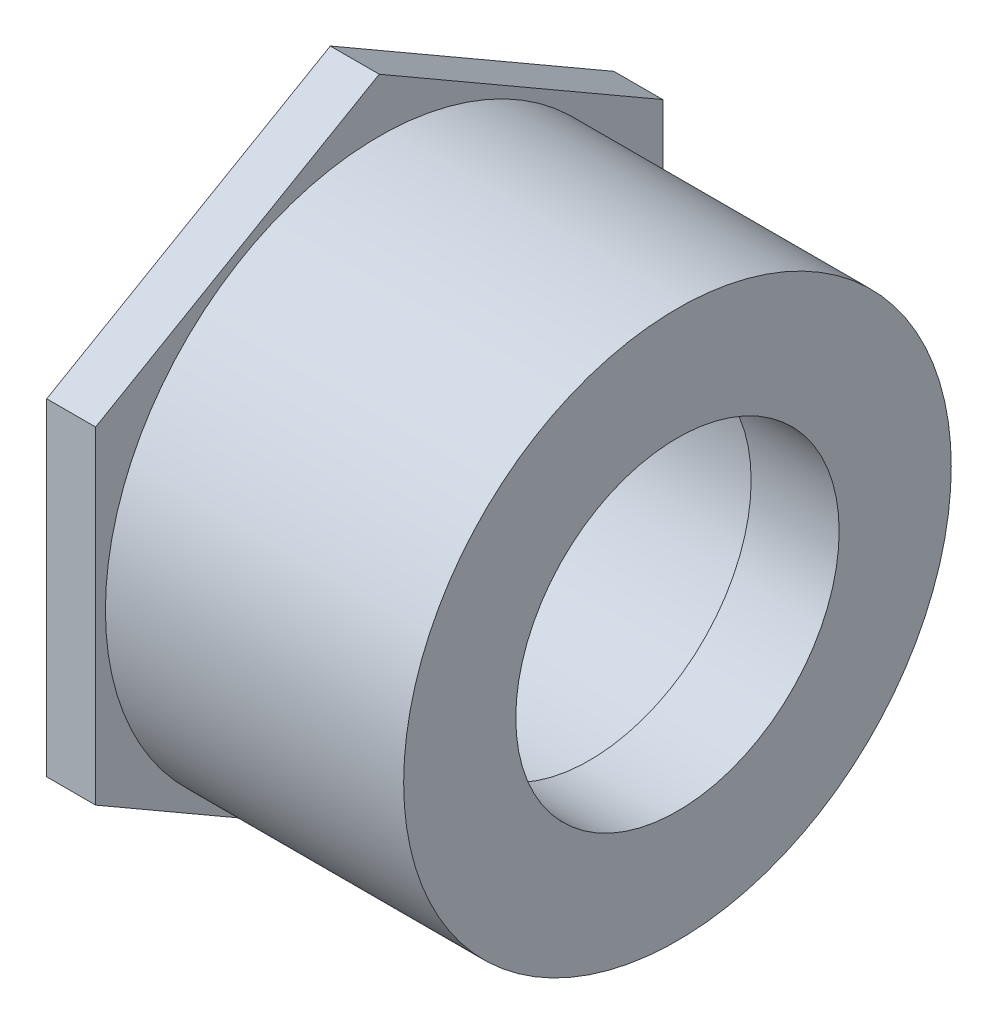
ISO-10303-21;
HEADER;
FILE_DESCRIPTION(('STEP AP214'),'2;1');
FILE_NAME('part.step','',(''),(''),'','','');
FILE_SCHEMA(('AUTOMOTIVE_DESIGN { 1 0 10303 214 1 1 1 1 }'));
ENDSEC;
DATA;
#1=APPLICATION_CONTEXT('core data for automotive mechanical design processes');
#2=APPLICATION_PROTOCOL_DEFINITION('international standard','automotive_design',2000,#1);
#3=PRODUCT_CONTEXT('',#1,'mechanical');
#4=PRODUCT('Part','Part','',(#3));
#5=PRODUCT_RELATED_PRODUCT_CATEGORY('part','',(#4));
#6=PRODUCT_DEFINITION_FORMATION('','',#4);
#7=PRODUCT_DEFINITION_CONTEXT('part definition',#1,'design');
#8=PRODUCT_DEFINITION('design','',#6,#7);
#9=PRODUCT_DEFINITION_SHAPE('','',#8);
#10=(LENGTH_UNIT() NAMED_UNIT(*) SI_UNIT(.MILLI.,.METRE.));
#11=(NAMED_UNIT(*) PLANE_ANGLE_UNIT() SI_UNIT($,.RADIAN.));
#12=(NAMED_UNIT(*) SI_UNIT($,.STERADIAN.) SOLID_ANGLE_UNIT());
#13=UNCERTAINTY_MEASURE_WITH_UNIT(LENGTH_MEASURE(1.E-05),#10,'distance_accuracy_value','');
#14=(GEOMETRIC_REPRESENTATION_CONTEXT(3) GLOBAL_UNCERTAINTY_ASSIGNED_CONTEXT((#13)) GLOBAL_UNIT_ASSIGNED_CONTEXT((#10,
#11,#12)) REPRESENTATION_CONTEXT('',''));
#15=CARTESIAN_POINT('',(0.,0.,0.));
#16=DIRECTION('',(0.,0.,1.));
#17=DIRECTION('',(1.,0.,0.));
#18=AXIS2_PLACEMENT_3D('',#15,#16,#17);
#19=CARTESIAN_POINT('',(-56.35625,0.,0.));
#20=DIRECTION('',(-1.,0.,0.));
#21=DIRECTION('',(0.,0.,1.));
#22=AXIS2_PLACEMENT_3D('',#19,#20,#21);
#23=CYLINDRICAL_SURFACE('',#22,44.45);
#24=CARTESIAN_POINT('',(0.,0.,0.));
#25=DIRECTION('',(-1.,0.,0.));
#26=DIRECTION('',(0.,0.,1.));
#27=AXIS2_PLACEMENT_3D('',#24,#25,#26);
#28=CIRCLE('',#27,44.45);
#29=CARTESIAN_POINT('',(0.,0.,44.45));
#30=VERTEX_POINT('',#29);
#31=EDGE_CURVE('E143',#30,#30,#28,.T.);
#32=ORIENTED_EDGE('',*,*,#31,.T.);
#33=EDGE_LOOP('',(#32));
#34=FACE_BOUND('',#33,.T.);
#35=CARTESIAN_POINT('',(-48.41875,0.,0.));
#36=DIRECTION('',(-1.,0.,0.));
#37=DIRECTION('',(0.,0.,1.));
#38=AXIS2_PLACEMENT_3D('',#35,#36,#37);
#39=CIRCLE('',#38,44.45);
#40=CARTESIAN_POINT('',(-48.41875,0.,44.45));
#41=VERTEX_POINT('',#40);
#42=EDGE_CURVE('E36',#41,#41,#39,.F.);
#43=ORIENTED_EDGE('',*,*,#42,.T.);
#44=EDGE_LOOP('',(#43));
#45=FACE_BOUND('',#44,.T.);
#46=ADVANCED_FACE('F32',(#34,#45),#23,.T.);
#47=CARTESIAN_POINT('',(-56.35625,-44.45,0.));
#48=DIRECTION('',(-1.,0.,0.));
#49=DIRECTION('',(0.,0.,1.));
#50=AXIS2_PLACEMENT_3D('',#47,#48,#49);
#51=PLANE('',#50);
#52=CARTESIAN_POINT('',(-56.35625,0.,0.));
#53=DIRECTION('',(-1.,0.,0.));
#54=DIRECTION('',(0.,0.,1.));
#55=AXIS2_PLACEMENT_3D('',#52,#53,#54);
#56=CIRCLE('',#55,30.3149);
#57=CARTESIAN_POINT('',(-56.35625,0.,30.3149));
#58=VERTEX_POINT('',#57);
#59=EDGE_CURVE('E11',#58,#58,#56,.T.);
#60=ORIENTED_EDGE('',*,*,#59,.F.);
#61=EDGE_LOOP('',(#60));
#62=FACE_BOUND('',#61,.T.);
#63=DIRECTION('',(0.,0.5,-0.866025403784439));
#64=VECTOR('',#63,1.);
#65=CARTESIAN_POINT('',(-56.35625,26.5797630178174,46.0375));
#66=LINE('',#65,#64);
#67=CARTESIAN_POINT('',(-56.35625,26.5797630178174,46.0375));
#68=VERTEX_POINT('',#67);
#69=CARTESIAN_POINT('',(-56.35625,53.1595260356348,0.));
#70=VERTEX_POINT('',#69);
#71=EDGE_CURVE('E121',#68,#70,#66,.T.);
#72=ORIENTED_EDGE('',*,*,#71,.T.);
#73=DIRECTION('',(0.,-0.5,-0.866025403784439));
#74=VECTOR('',#73,1.);
#75=CARTESIAN_POINT('',(-56.35625,53.1595260356348,0.));
#76=LINE('',#75,#74);
#77=CARTESIAN_POINT('',(-56.35625,26.5797630178174,-46.0375));
#78=VERTEX_POINT('',#77);
#79=EDGE_CURVE('E124',#70,#78,#76,.T.);
#80=ORIENTED_EDGE('',*,*,#79,.T.);
#81=DIRECTION('',(0.,-1.,0.));
#82=VECTOR('',#81,1.);
#83=CARTESIAN_POINT('',(-56.35625,26.5797630178174,-46.0375));
#84=LINE('',#83,#82);
#85=CARTESIAN_POINT('',(-56.35625,-26.5797630178174,-46.0375));
#86=VERTEX_POINT('',#85);
#87=EDGE_CURVE('E127',#78,#86,#84,.T.);
#88=ORIENTED_EDGE('',*,*,#87,.T.);
#89=DIRECTION('',(0.,-0.5,0.866025403784439));
#90=VECTOR('',#89,1.);
#91=CARTESIAN_POINT('',(-56.35625,-26.5797630178174,-46.0375));
#92=LINE('',#91,#90);
#93=CARTESIAN_POINT('',(-56.35625,-53.1595260356348,0.));
#94=VERTEX_POINT('',#93);
#95=EDGE_CURVE('E130',#86,#94,#92,.T.);
#96=ORIENTED_EDGE('',*,*,#95,.T.);
#97=DIRECTION('',(0.,0.5,0.866025403784439));
#98=VECTOR('',#97,1.);
#99=CARTESIAN_POINT('',(-56.35625,-53.1595260356348,0.));
#100=LINE('',#99,#98);
#101=CARTESIAN_POINT('',(-56.35625,-26.5797630178174,46.0375));
#102=VERTEX_POINT('',#101);
#103=EDGE_CURVE('E98',#94,#102,#100,.T.);
#104=ORIENTED_EDGE('',*,*,#103,.T.);
#105=DIRECTION('',(0.,1.,0.));
#106=VECTOR('',#105,1.);
#107=CARTESIAN_POINT('',(-56.35625,-26.5797630178174,46.0375));
#108=LINE('',#107,#106);
#109=EDGE_CURVE('E133',#102,#68,#108,.T.);
#110=ORIENTED_EDGE('',*,*,#109,.T.);
#111=EDGE_LOOP('',(#72,#80,#88,#96,#104,#110));
#112=FACE_BOUND('',#111,.T.);
#113=ADVANCED_FACE('F34',(#62,#112),#51,.T.);
#114=CARTESIAN_POINT('',(-14.2875,0.,0.));
#115=DIRECTION('',(-1.,0.,0.));
#116=DIRECTION('',(0.,0.,1.));
#117=AXIS2_PLACEMENT_3D('',#114,#115,#116);
#118=CONICAL_SURFACE('',#117,30.0863,0.00543390878051716);
#119=ORIENTED_EDGE('',*,*,#59,.T.);
#120=EDGE_LOOP('',(#119));
#121=FACE_BOUND('',#120,.T.);
#122=CARTESIAN_POINT('',(-14.2875,0.,0.));
#123=DIRECTION('',(-1.,0.,0.));
#124=DIRECTION('',(0.,0.,1.));
#125=AXIS2_PLACEMENT_3D('',#122,#123,#124);
#126=CIRCLE('',#125,30.0863);
#127=CARTESIAN_POINT('',(-14.2875,0.,30.0863));
#128=VERTEX_POINT('',#127);
#129=EDGE_CURVE('E42',#128,#128,#126,.T.);
#130=ORIENTED_EDGE('',*,*,#129,.F.);
#131=EDGE_LOOP('',(#130));
#132=FACE_BOUND('',#131,.T.);
#133=ADVANCED_FACE('F158',(#121,#132),#118,.F.);
#134=CARTESIAN_POINT('',(-14.2875,-26.2509,0.));
#135=DIRECTION('',(-1.,0.,0.));
#136=DIRECTION('',(0.,0.,1.));
#137=AXIS2_PLACEMENT_3D('',#134,#135,#136);
#138=PLANE('',#137);
#139=ORIENTED_EDGE('',*,*,#129,.T.);
#140=EDGE_LOOP('',(#139));
#141=FACE_BOUND('',#140,.T.);
#142=CARTESIAN_POINT('',(-14.2875,0.,0.));
#143=DIRECTION('',(-1.,0.,0.));
#144=DIRECTION('',(0.,0.,1.));
#145=AXIS2_PLACEMENT_3D('',#142,#143,#144);
#146=CIRCLE('',#145,26.2509);
#147=CARTESIAN_POINT('',(-14.2875,0.,26.2509));
#148=VERTEX_POINT('',#147);
#149=EDGE_CURVE('E149',#148,#148,#146,.T.);
#150=ORIENTED_EDGE('',*,*,#149,.F.);
#151=EDGE_LOOP('',(#150));
#152=FACE_BOUND('',#151,.T.);
#153=ADVANCED_FACE('F155',(#141,#152),#138,.T.);
#154=CARTESIAN_POINT('',(-56.35625,0.,0.));
#155=DIRECTION('',(-1.,0.,0.));
#156=DIRECTION('',(0.,0.,1.));
#157=AXIS2_PLACEMENT_3D('',#154,#155,#156);
#158=CYLINDRICAL_SURFACE('',#157,26.2509);
#159=ORIENTED_EDGE('',*,*,#149,.T.);
#160=EDGE_LOOP('',(#159));
#161=FACE_BOUND('',#160,.T.);
#162=CARTESIAN_POINT('',(0.,0.,0.));
#163=DIRECTION('',(-1.,0.,0.));
#164=DIRECTION('',(0.,0.,1.));
#165=AXIS2_PLACEMENT_3D('',#162,#163,#164);
#166=CIRCLE('',#165,26.2509);
#167=CARTESIAN_POINT('',(0.,0.,26.2509));
#168=VERTEX_POINT('',#167);
#169=EDGE_CURVE('E146',#168,#168,#166,.T.);
#170=ORIENTED_EDGE('',*,*,#169,.F.);
#171=EDGE_LOOP('',(#170));
#172=FACE_BOUND('',#171,.T.);
#173=ADVANCED_FACE('F165',(#161,#172),#158,.F.);
#174=CARTESIAN_POINT('',(0.,-26.2509,0.));
#175=DIRECTION('',(1.,0.,0.));
#176=DIRECTION('',(0.,0.,-1.));
#177=AXIS2_PLACEMENT_3D('',#174,#175,#176);
#178=PLANE('',#177);
#179=ORIENTED_EDGE('',*,*,#169,.T.);
#180=EDGE_LOOP('',(#179));
#181=FACE_BOUND('',#180,.T.);
#182=ORIENTED_EDGE('',*,*,#31,.F.);
#183=EDGE_LOOP('',(#182));
#184=FACE_BOUND('',#183,.T.);
#185=ADVANCED_FACE('F178',(#181,#184),#178,.T.);
#186=CARTESIAN_POINT('',(-48.41875,26.5797630178174,46.0375));
#187=DIRECTION('',(0.,0.866025403784439,0.5));
#188=DIRECTION('',(0.,-0.5,0.866025403784439));
#189=AXIS2_PLACEMENT_3D('',#186,#187,#188);
#190=PLANE('',#189);
#191=ORIENTED_EDGE('',*,*,#71,.F.);
#192=DIRECTION('',(-1.,0.,0.));
#193=VECTOR('',#192,1.);
#194=CARTESIAN_POINT('',(-48.41875,26.5797630178174,46.0375));
#195=LINE('',#194,#193);
#196=CARTESIAN_POINT('',(-48.41875,26.5797630178174,46.0375));
#197=VERTEX_POINT('',#196);
#198=EDGE_CURVE('E50',#197,#68,#195,.T.);
#199=ORIENTED_EDGE('',*,*,#198,.F.);
#200=DIRECTION('',(0.,0.5,-0.866025403784439));
#201=VECTOR('',#200,1.);
#202=CARTESIAN_POINT('',(-48.41875,26.5797630178174,46.0375));
#203=LINE('',#202,#201);
#204=CARTESIAN_POINT('',(-48.41875,53.1595260356348,0.));
#205=VERTEX_POINT('',#204);
#206=EDGE_CURVE('E136',#197,#205,#203,.T.);
#207=ORIENTED_EDGE('',*,*,#206,.T.);
#208=DIRECTION('',(-1.,0.,0.));
#209=VECTOR('',#208,1.);
#210=CARTESIAN_POINT('',(-48.41875,53.1595260356348,0.));
#211=LINE('',#210,#209);
#212=EDGE_CURVE('E85',#205,#70,#211,.T.);
#213=ORIENTED_EDGE('',*,*,#212,.T.);
#214=EDGE_LOOP('',(#191,#199,#207,#213));
#215=FACE_BOUND('',#214,.T.);
#216=ADVANCED_FACE('F176',(#215),#190,.T.);
#217=CARTESIAN_POINT('',(-48.41875,-26.5797630178174,46.0375));
#218=DIRECTION('',(0.,0.,1.));
#219=DIRECTION('',(0.,-1.,0.));
#220=AXIS2_PLACEMENT_3D('',#217,#218,#219);
#221=PLANE('',#220);
#222=ORIENTED_EDGE('',*,*,#109,.F.);
#223=DIRECTION('',(-1.,0.,0.));
#224=VECTOR('',#223,1.);
#225=CARTESIAN_POINT('',(-48.41875,-26.5797630178174,46.0375));
#226=LINE('',#225,#224);
#227=CARTESIAN_POINT('',(-48.41875,-26.5797630178174,46.0375));
#228=VERTEX_POINT('',#227);
#229=EDGE_CURVE('E73',#228,#102,#226,.T.);
#230=ORIENTED_EDGE('',*,*,#229,.F.);
#231=DIRECTION('',(0.,1.,0.));
#232=VECTOR('',#231,1.);
#233=CARTESIAN_POINT('',(-48.41875,-26.5797630178174,46.0375));
#234=LINE('',#233,#232);
#235=EDGE_CURVE('E111',#228,#197,#234,.T.);
#236=ORIENTED_EDGE('',*,*,#235,.T.);
#237=ORIENTED_EDGE('',*,*,#198,.T.);
#238=EDGE_LOOP('',(#222,#230,#236,#237));
#239=FACE_BOUND('',#238,.T.);
#240=ADVANCED_FACE('F203',(#239),#221,.T.);
#241=CARTESIAN_POINT('',(-48.41875,-53.1595260356348,0.));
#242=DIRECTION('',(0.,-0.866025403784439,0.5));
#243=DIRECTION('',(0.,-0.5,-0.866025403784439));
#244=AXIS2_PLACEMENT_3D('',#241,#242,#243);
#245=PLANE('',#244);
#246=ORIENTED_EDGE('',*,*,#103,.F.);
#247=DIRECTION('',(-1.,0.,0.));
#248=VECTOR('',#247,1.);
#249=CARTESIAN_POINT('',(-48.41875,-53.1595260356348,0.));
#250=LINE('',#249,#248);
#251=CARTESIAN_POINT('',(-48.41875,-53.1595260356348,0.));
#252=VERTEX_POINT('',#251);
#253=EDGE_CURVE('E93',#252,#94,#250,.T.);
#254=ORIENTED_EDGE('',*,*,#253,.F.);
#255=DIRECTION('',(0.,0.5,0.866025403784439));
#256=VECTOR('',#255,1.);
#257=CARTESIAN_POINT('',(-48.41875,-53.1595260356348,0.));
#258=LINE('',#257,#256);
#259=EDGE_CURVE('E96',#252,#228,#258,.T.);
#260=ORIENTED_EDGE('',*,*,#259,.T.);
#261=ORIENTED_EDGE('',*,*,#229,.T.);
#262=EDGE_LOOP('',(#246,#254,#260,#261));
#263=FACE_BOUND('',#262,.T.);
#264=ADVANCED_FACE('F95',(#263),#245,.T.);
#265=CARTESIAN_POINT('',(-48.41875,-26.5797630178174,-46.0375));
#266=DIRECTION('',(0.,-0.866025403784439,-0.5));
#267=DIRECTION('',(0.,0.5,-0.866025403784439));
#268=AXIS2_PLACEMENT_3D('',#265,#266,#267);
#269=PLANE('',#268);
#270=ORIENTED_EDGE('',*,*,#95,.F.);
#271=DIRECTION('',(-1.,0.,0.));
#272=VECTOR('',#271,1.);
#273=CARTESIAN_POINT('',(-48.41875,-26.5797630178174,-46.0375));
#274=LINE('',#273,#272);
#275=CARTESIAN_POINT('',(-48.41875,-26.5797630178174,-46.0375));
#276=VERTEX_POINT('',#275);
#277=EDGE_CURVE('E103',#276,#86,#274,.T.);
#278=ORIENTED_EDGE('',*,*,#277,.F.);
#279=DIRECTION('',(0.,-0.5,0.866025403784439));
#280=VECTOR('',#279,1.);
#281=CARTESIAN_POINT('',(-48.41875,-26.5797630178174,-46.0375));
#282=LINE('',#281,#280);
#283=EDGE_CURVE('E109',#276,#252,#282,.T.);
#284=ORIENTED_EDGE('',*,*,#283,.T.);
#285=ORIENTED_EDGE('',*,*,#253,.T.);
#286=EDGE_LOOP('',(#270,#278,#284,#285));
#287=FACE_BOUND('',#286,.T.);
#288=ADVANCED_FACE('F113',(#287),#269,.T.);
#289=CARTESIAN_POINT('',(-48.41875,26.5797630178174,-46.0375));
#290=DIRECTION('',(0.,0.,-1.));
#291=DIRECTION('',(0.,1.,0.));
#292=AXIS2_PLACEMENT_3D('',#289,#290,#291);
#293=PLANE('',#292);
#294=ORIENTED_EDGE('',*,*,#87,.F.);
#295=DIRECTION('',(-1.,0.,0.));
#296=VECTOR('',#295,1.);
#297=CARTESIAN_POINT('',(-48.41875,26.5797630178174,-46.0375));
#298=LINE('',#297,#296);
#299=CARTESIAN_POINT('',(-48.41875,26.5797630178174,-46.0375));
#300=VERTEX_POINT('',#299);
#301=EDGE_CURVE('E140',#300,#78,#298,.T.);
#302=ORIENTED_EDGE('',*,*,#301,.F.);
#303=DIRECTION('',(0.,-1.,0.));
#304=VECTOR('',#303,1.);
#305=CARTESIAN_POINT('',(-48.41875,26.5797630178174,-46.0375));
#306=LINE('',#305,#304);
#307=EDGE_CURVE('E114',#300,#276,#306,.T.);
#308=ORIENTED_EDGE('',*,*,#307,.T.);
#309=ORIENTED_EDGE('',*,*,#277,.T.);
#310=EDGE_LOOP('',(#294,#302,#308,#309));
#311=FACE_BOUND('',#310,.T.);
#312=ADVANCED_FACE('F222',(#311),#293,.T.);
#313=CARTESIAN_POINT('',(-48.41875,53.1595260356348,0.));
#314=DIRECTION('',(0.,0.866025403784439,-0.5));
#315=DIRECTION('',(0.,0.5,0.866025403784439));
#316=AXIS2_PLACEMENT_3D('',#313,#314,#315);
#317=PLANE('',#316);
#318=ORIENTED_EDGE('',*,*,#79,.F.);
#319=ORIENTED_EDGE('',*,*,#212,.F.);
#320=DIRECTION('',(0.,-0.5,-0.866025403784439));
#321=VECTOR('',#320,1.);
#322=CARTESIAN_POINT('',(-48.41875,53.1595260356348,0.));
#323=LINE('',#322,#321);
#324=EDGE_CURVE('E116',#205,#300,#323,.T.);
#325=ORIENTED_EDGE('',*,*,#324,.T.);
#326=ORIENTED_EDGE('',*,*,#301,.T.);
#327=EDGE_LOOP('',(#318,#319,#325,#326));
#328=FACE_BOUND('',#327,.T.);
#329=ADVANCED_FACE('F229',(#328),#317,.T.);
#330=CARTESIAN_POINT('',(-48.41875,53.1595260356348,0.));
#331=DIRECTION('',(-1.,0.,0.));
#332=DIRECTION('',(0.,0.,1.));
#333=AXIS2_PLACEMENT_3D('',#330,#331,#332);
#334=PLANE('',#333);
#335=ORIENTED_EDGE('',*,*,#42,.F.);
#336=EDGE_LOOP('',(#335));
#337=FACE_BOUND('',#336,.T.);
#338=ORIENTED_EDGE('',*,*,#206,.F.);
#339=ORIENTED_EDGE('',*,*,#235,.F.);
#340=ORIENTED_EDGE('',*,*,#259,.F.);
#341=ORIENTED_EDGE('',*,*,#283,.F.);
#342=ORIENTED_EDGE('',*,*,#307,.F.);
#343=ORIENTED_EDGE('',*,*,#324,.F.);
#344=EDGE_LOOP('',(#338,#339,#340,#341,#342,#343));
#345=FACE_BOUND('',#344,.T.);
#346=ADVANCED_FACE('F107',(#337,#345),#334,.F.);
#347=CLOSED_SHELL('',(#46,#113,#133,#153,#173,#185,#216,#240,#264,#288,#312,#329,#346));
#348=MANIFOLD_SOLID_BREP('B2',#347);
#349=ADVANCED_BREP_SHAPE_REPRESENTATION('',(#18,#348),#14);
#350=SHAPE_DEFINITION_REPRESENTATION(#9,#349);
ENDSEC;
END-ISO-10303-21;
